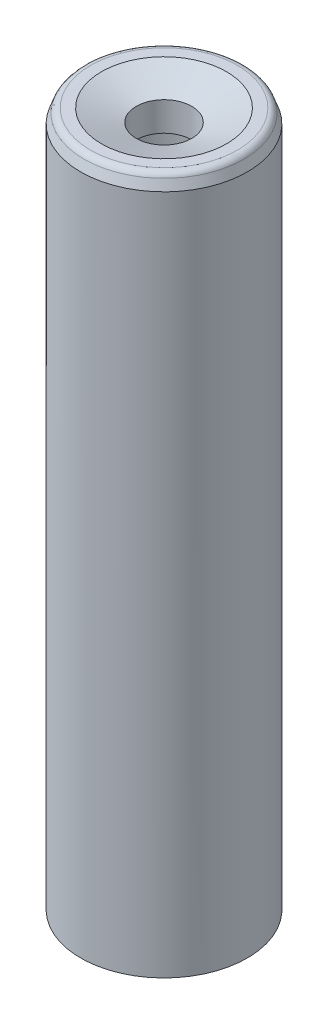
ISO-10303-21;
HEADER;
FILE_DESCRIPTION(('STEP AP214'),'2;1');
FILE_NAME('part.step','',(''),(''),'','','');
FILE_SCHEMA(('AUTOMOTIVE_DESIGN { 1 0 10303 214 1 1 1 1 }'));
ENDSEC;
DATA;
#1=APPLICATION_CONTEXT('core data for automotive mechanical design processes');
#2=APPLICATION_PROTOCOL_DEFINITION('international standard','automotive_design',2000,#1);
#3=PRODUCT_CONTEXT('',#1,'mechanical');
#4=PRODUCT('Part','Part','',(#3));
#5=PRODUCT_RELATED_PRODUCT_CATEGORY('part','',(#4));
#6=PRODUCT_DEFINITION_FORMATION('','',#4);
#7=PRODUCT_DEFINITION_CONTEXT('part definition',#1,'design');
#8=PRODUCT_DEFINITION('design','',#6,#7);
#9=PRODUCT_DEFINITION_SHAPE('','',#8);
#10=(LENGTH_UNIT() NAMED_UNIT(*) SI_UNIT(.MILLI.,.METRE.));
#11=(NAMED_UNIT(*) PLANE_ANGLE_UNIT() SI_UNIT($,.RADIAN.));
#12=(NAMED_UNIT(*) SI_UNIT($,.STERADIAN.) SOLID_ANGLE_UNIT());
#13=UNCERTAINTY_MEASURE_WITH_UNIT(LENGTH_MEASURE(1.E-05),#10,'distance_accuracy_value','');
#14=(GEOMETRIC_REPRESENTATION_CONTEXT(3) GLOBAL_UNCERTAINTY_ASSIGNED_CONTEXT((#13)) GLOBAL_UNIT_ASSIGNED_CONTEXT((#10,
#11,#12)) REPRESENTATION_CONTEXT('',''));
#15=CARTESIAN_POINT('',(0.,0.,0.));
#16=DIRECTION('',(0.,0.,1.));
#17=DIRECTION('',(1.,0.,0.));
#18=AXIS2_PLACEMENT_3D('',#15,#16,#17);
#19=CARTESIAN_POINT('',(0.,40.,0.));
#20=DIRECTION('',(0.,-1.,0.));
#21=DIRECTION('',(0.,0.,-1.));
#22=AXIS2_PLACEMENT_3D('',#19,#20,#21);
#23=CYLINDRICAL_SURFACE('',#22,4.);
#24=CARTESIAN_POINT('',(0.,37.,0.));
#25=DIRECTION('',(0.,1.,0.));
#26=DIRECTION('',(0.,0.,1.));
#27=AXIS2_PLACEMENT_3D('',#24,#25,#26);
#28=CIRCLE('',#27,4.);
#29=CARTESIAN_POINT('',(0.,37.,4.));
#30=VERTEX_POINT('',#29);
#31=EDGE_CURVE('E65',#30,#30,#28,.T.);
#32=ORIENTED_EDGE('',*,*,#31,.T.);
#33=EDGE_LOOP('',(#32));
#34=FACE_BOUND('',#33,.T.);
#35=CARTESIAN_POINT('',(0.,-10.,0.));
#36=DIRECTION('',(0.,-1.,0.));
#37=DIRECTION('',(0.,0.,-1.));
#38=AXIS2_PLACEMENT_3D('',#35,#36,#37);
#39=CIRCLE('',#38,4.);
#40=CARTESIAN_POINT('',(0.,-10.,-4.));
#41=VERTEX_POINT('',#40);
#42=EDGE_CURVE('E74',#41,#41,#39,.T.);
#43=ORIENTED_EDGE('',*,*,#42,.T.);
#44=EDGE_LOOP('',(#43));
#45=FACE_BOUND('',#44,.T.);
#46=ADVANCED_FACE('F42',(#34,#45),#23,.F.);
#47=CARTESIAN_POINT('',(0.,40.,0.));
#48=DIRECTION('',(0.,1.,0.));
#49=DIRECTION('',(0.,0.,1.));
#50=AXIS2_PLACEMENT_3D('',#47,#48,#49);
#51=PLANE('',#50);
#52=CARTESIAN_POINT('',(0.,40.,0.));
#53=DIRECTION('',(0.,1.,0.));
#54=DIRECTION('',(0.,0.,1.));
#55=AXIS2_PLACEMENT_3D('',#52,#53,#54);
#56=CIRCLE('',#55,5.28592599662894);
#57=CARTESIAN_POINT('',(0.,40.,5.28592599662894));
#58=VERTEX_POINT('',#57);
#59=EDGE_CURVE('E49',#58,#58,#56,.T.);
#60=ORIENTED_EDGE('',*,*,#59,.T.);
#61=EDGE_LOOP('',(#60));
#62=FACE_BOUND('',#61,.T.);
#63=CARTESIAN_POINT('',(0.,40.,0.));
#64=DIRECTION('',(0.,1.,0.));
#65=DIRECTION('',(0.,0.,1.));
#66=AXIS2_PLACEMENT_3D('',#63,#64,#65);
#67=CIRCLE('',#66,4.50000000000002);
#68=CARTESIAN_POINT('',(0.,40.,4.50000000000002));
#69=VERTEX_POINT('',#68);
#70=EDGE_CURVE('E57',#69,#69,#67,.F.);
#71=ORIENTED_EDGE('',*,*,#70,.T.);
#72=EDGE_LOOP('',(#71));
#73=FACE_BOUND('',#72,.T.);
#74=ADVANCED_FACE('F90',(#62,#73),#51,.T.);
#75=CARTESIAN_POINT('',(0.,40.,0.));
#76=DIRECTION('',(0.,-1.,0.));
#77=DIRECTION('',(0.,0.,-1.));
#78=AXIS2_PLACEMENT_3D('',#75,#76,#77);
#79=CYLINDRICAL_SURFACE('',#78,6.);
#80=CARTESIAN_POINT('',(0.,39.,0.));
#81=DIRECTION('',(0.,1.,0.));
#82=DIRECTION('',(0.,0.,1.));
#83=AXIS2_PLACEMENT_3D('',#80,#81,#82);
#84=CIRCLE('',#83,6.);
#85=CARTESIAN_POINT('',(0.,39.,6.));
#86=VERTEX_POINT('',#85);
#87=EDGE_CURVE('E53',#86,#86,#84,.F.);
#88=ORIENTED_EDGE('',*,*,#87,.T.);
#89=EDGE_LOOP('',(#88));
#90=FACE_BOUND('',#89,.T.);
#91=CARTESIAN_POINT('',(0.,-10.,0.));
#92=DIRECTION('',(0.,-1.,0.));
#93=DIRECTION('',(0.,0.,-1.));
#94=AXIS2_PLACEMENT_3D('',#91,#92,#93);
#95=CIRCLE('',#94,6.);
#96=CARTESIAN_POINT('',(0.,-10.,-6.));
#97=VERTEX_POINT('',#96);
#98=EDGE_CURVE('E69',#97,#97,#95,.T.);
#99=ORIENTED_EDGE('',*,*,#98,.F.);
#100=EDGE_LOOP('',(#99));
#101=FACE_BOUND('',#100,.T.);
#102=ADVANCED_FACE('F96',(#90,#101),#79,.T.);
#103=CARTESIAN_POINT('',(0.,37.,0.));
#104=DIRECTION('',(0.,1.,0.));
#105=DIRECTION('',(0.,0.,1.));
#106=AXIS2_PLACEMENT_3D('',#103,#104,#105);
#107=PLANE('',#106);
#108=CARTESIAN_POINT('',(0.,37.,0.));
#109=DIRECTION('',(0.,1.,0.));
#110=DIRECTION('',(0.,0.,1.));
#111=AXIS2_PLACEMENT_3D('',#108,#109,#110);
#112=CIRCLE('',#111,2.);
#113=CARTESIAN_POINT('',(0.,37.,2.));
#114=VERTEX_POINT('',#113);
#115=EDGE_CURVE('E66',#114,#114,#112,.T.);
#116=ORIENTED_EDGE('',*,*,#115,.T.);
#117=EDGE_LOOP('',(#116));
#118=FACE_BOUND('',#117,.T.);
#119=ORIENTED_EDGE('',*,*,#31,.F.);
#120=EDGE_LOOP('',(#119));
#121=FACE_BOUND('',#120,.T.);
#122=ADVANCED_FACE('F99',(#118,#121),#107,.F.);
#123=CARTESIAN_POINT('',(0.,0.,0.));
#124=DIRECTION('',(0.,1.,0.));
#125=DIRECTION('',(0.,0.,1.));
#126=AXIS2_PLACEMENT_3D('',#123,#124,#125);
#127=CYLINDRICAL_SURFACE('',#126,2.);
#128=CARTESIAN_POINT('',(0.,39.0900744143345,0.));
#129=DIRECTION('',(0.,1.,0.));
#130=DIRECTION('',(0.,0.,1.));
#131=AXIS2_PLACEMENT_3D('',#128,#129,#130);
#132=CIRCLE('',#131,2.);
#133=CARTESIAN_POINT('',(0.,39.0900744143345,2.));
#134=VERTEX_POINT('',#133);
#135=EDGE_CURVE('E62',#134,#134,#132,.T.);
#136=ORIENTED_EDGE('',*,*,#135,.T.);
#137=EDGE_LOOP('',(#136));
#138=FACE_BOUND('',#137,.T.);
#139=ORIENTED_EDGE('',*,*,#115,.F.);
#140=EDGE_LOOP('',(#139));
#141=FACE_BOUND('',#140,.T.);
#142=ADVANCED_FACE('F106',(#138,#141),#127,.F.);
#143=CARTESIAN_POINT('',(0.,39.0900744143345,0.));
#144=DIRECTION('',(0.,1.,0.));
#145=DIRECTION('',(0.,0.,1.));
#146=AXIS2_PLACEMENT_3D('',#143,#144,#145);
#147=CONICAL_SURFACE('',#146,2.,1.22173047639603);
#148=ORIENTED_EDGE('',*,*,#70,.F.);
#149=EDGE_LOOP('',(#148));
#150=FACE_BOUND('',#149,.T.);
#151=ORIENTED_EDGE('',*,*,#135,.F.);
#152=EDGE_LOOP('',(#151));
#153=FACE_BOUND('',#152,.T.);
#154=ADVANCED_FACE('F104',(#150,#153),#147,.F.);
#155=CARTESIAN_POINT('',(0.,40.,0.));
#156=DIRECTION('',(0.,-1.,0.));
#157=DIRECTION('',(0.,0.,-1.));
#158=AXIS2_PLACEMENT_3D('',#155,#156,#157);
#159=CONICAL_SURFACE('',#158,5.6360297657338,0.349065850398862);
#160=CARTESIAN_POINT('',(0.,39.6710100716628,0.));
#161=DIRECTION('',(0.,1.,0.));
#162=DIRECTION('',(0.,0.,1.));
#163=AXIS2_PLACEMENT_3D('',#160,#161,#162);
#164=CIRCLE('',#163,5.75577230702189);
#165=CARTESIAN_POINT('',(0.,39.6710100716628,5.75577230702189));
#166=VERTEX_POINT('',#165);
#167=EDGE_CURVE('E12',#166,#166,#164,.F.);
#168=ORIENTED_EDGE('',*,*,#167,.T.);
#169=EDGE_LOOP('',(#168));
#170=FACE_BOUND('',#169,.T.);
#171=ORIENTED_EDGE('',*,*,#87,.F.);
#172=EDGE_LOOP('',(#171));
#173=FACE_BOUND('',#172,.T.);
#174=ADVANCED_FACE('F86',(#170,#173),#159,.T.);
#175=CARTESIAN_POINT('',(0.,39.5,0.));
#176=DIRECTION('',(0.,1.,0.));
#177=DIRECTION('',(0.,0.,1.));
#178=AXIS2_PLACEMENT_3D('',#175,#176,#177);
#179=TOROIDAL_SURFACE('',#178,5.28592599662894,0.5);
#180=ORIENTED_EDGE('',*,*,#167,.F.);
#181=EDGE_LOOP('',(#180));
#182=FACE_BOUND('',#181,.T.);
#183=ORIENTED_EDGE('',*,*,#59,.F.);
#184=EDGE_LOOP('',(#183));
#185=FACE_BOUND('',#184,.T.);
#186=ADVANCED_FACE('F44',(#182,#185),#179,.T.);
#187=CARTESIAN_POINT('',(0.,-10.,0.));
#188=DIRECTION('',(0.,-1.,0.));
#189=DIRECTION('',(0.,0.,-1.));
#190=AXIS2_PLACEMENT_3D('',#187,#188,#189);
#191=PLANE('',#190);
#192=ORIENTED_EDGE('',*,*,#98,.T.);
#193=EDGE_LOOP('',(#192));
#194=FACE_BOUND('',#193,.T.);
#195=ORIENTED_EDGE('',*,*,#42,.F.);
#196=EDGE_LOOP('',(#195));
#197=FACE_BOUND('',#196,.T.);
#198=ADVANCED_FACE('F79',(#194,#197),#191,.T.);
#199=CLOSED_SHELL('',(#46,#74,#102,#122,#142,#154,#174,#186,#198));
#200=MANIFOLD_SOLID_BREP('B2',#199);
#201=ADVANCED_BREP_SHAPE_REPRESENTATION('',(#18,#200),#14);
#202=SHAPE_DEFINITION_REPRESENTATION(#9,#201);
ENDSEC;
END-ISO-10303-21;
